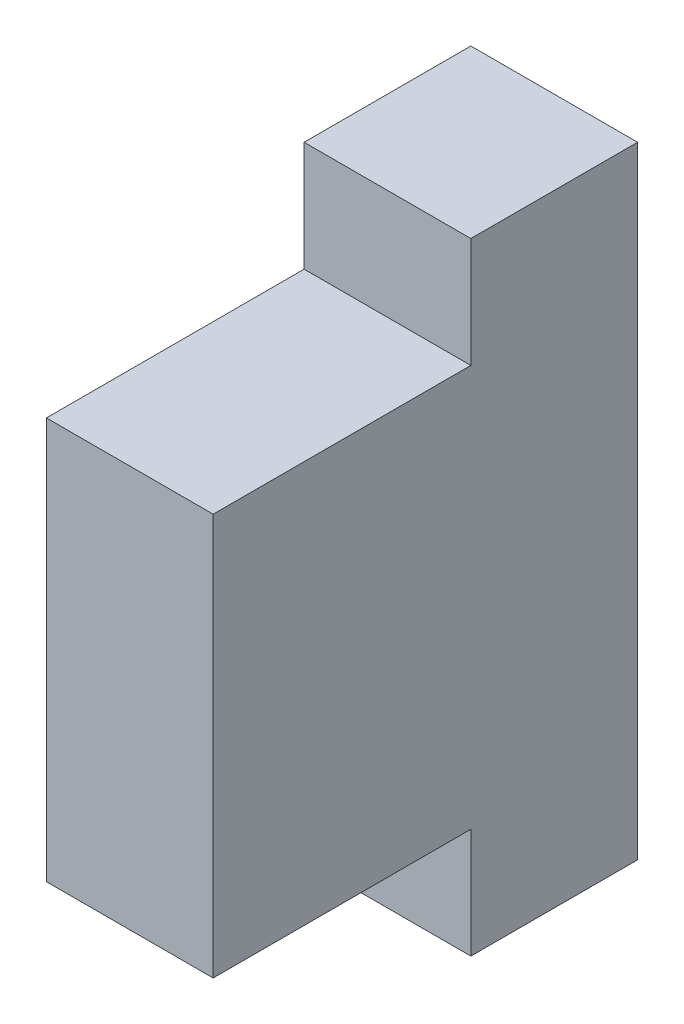
ISO-10303-21;
HEADER;
FILE_DESCRIPTION(('STEP AP214'),'2;1');
FILE_NAME('part.step','',(''),(''),'','','');
FILE_SCHEMA(('AUTOMOTIVE_DESIGN { 1 0 10303 214 1 1 1 1 }'));
ENDSEC;
DATA;
#1=APPLICATION_CONTEXT('core data for automotive mechanical design processes');
#2=APPLICATION_PROTOCOL_DEFINITION('international standard','automotive_design',2000,#1);
#3=PRODUCT_CONTEXT('',#1,'mechanical');
#4=PRODUCT('Part','Part','',(#3));
#5=PRODUCT_RELATED_PRODUCT_CATEGORY('part','',(#4));
#6=PRODUCT_DEFINITION_FORMATION('','',#4);
#7=PRODUCT_DEFINITION_CONTEXT('part definition',#1,'design');
#8=PRODUCT_DEFINITION('design','',#6,#7);
#9=PRODUCT_DEFINITION_SHAPE('','',#8);
#10=(LENGTH_UNIT() NAMED_UNIT(*) SI_UNIT(.MILLI.,.METRE.));
#11=(NAMED_UNIT(*) PLANE_ANGLE_UNIT() SI_UNIT($,.RADIAN.));
#12=(NAMED_UNIT(*) SI_UNIT($,.STERADIAN.) SOLID_ANGLE_UNIT());
#13=UNCERTAINTY_MEASURE_WITH_UNIT(LENGTH_MEASURE(1.E-05),#10,'distance_accuracy_value','');
#14=(GEOMETRIC_REPRESENTATION_CONTEXT(3) GLOBAL_UNCERTAINTY_ASSIGNED_CONTEXT((#13)) GLOBAL_UNIT_ASSIGNED_CONTEXT((#10,
#11,#12)) REPRESENTATION_CONTEXT('',''));
#15=CARTESIAN_POINT('',(0.,0.,0.));
#16=DIRECTION('',(0.,0.,1.));
#17=DIRECTION('',(1.,0.,0.));
#18=AXIS2_PLACEMENT_3D('',#15,#16,#17);
#19=CARTESIAN_POINT('',(-1.35,-1.6875,3.6));
#20=DIRECTION('',(0.,0.,-1.));
#21=DIRECTION('',(0.,-1.,0.));
#22=AXIS2_PLACEMENT_3D('',#19,#20,#21);
#23=PLANE('',#22);
#24=DIRECTION('',(0.,-1.,0.));
#25=VECTOR('',#24,1.);
#26=CARTESIAN_POINT('',(-0.8,-1.325,3.6));
#27=LINE('',#26,#25);
#28=CARTESIAN_POINT('',(-0.8,-1.325,3.6));
#29=VERTEX_POINT('',#28);
#30=CARTESIAN_POINT('',(-0.8,-2.05,3.6));
#31=VERTEX_POINT('',#30);
#32=EDGE_CURVE('E155',#29,#31,#27,.T.);
#33=ORIENTED_EDGE('',*,*,#32,.F.);
#34=DIRECTION('',(1.,0.,0.));
#35=VECTOR('',#34,1.);
#36=CARTESIAN_POINT('',(-1.9,-1.325,3.6));
#37=LINE('',#36,#35);
#38=CARTESIAN_POINT('',(-1.9,-1.325,3.6));
#39=VERTEX_POINT('',#38);
#40=EDGE_CURVE('E201',#39,#29,#37,.T.);
#41=ORIENTED_EDGE('',*,*,#40,.F.);
#42=DIRECTION('',(0.,1.,0.));
#43=VECTOR('',#42,1.);
#44=CARTESIAN_POINT('',(-1.9,-2.05,3.6));
#45=LINE('',#44,#43);
#46=CARTESIAN_POINT('',(-1.9,-2.05,3.6));
#47=VERTEX_POINT('',#46);
#48=EDGE_CURVE('E104',#47,#39,#45,.T.);
#49=ORIENTED_EDGE('',*,*,#48,.F.);
#50=DIRECTION('',(-1.,0.,0.));
#51=VECTOR('',#50,1.);
#52=CARTESIAN_POINT('',(-0.8,-2.05,3.6));
#53=LINE('',#52,#51);
#54=EDGE_CURVE('E11',#31,#47,#53,.T.);
#55=ORIENTED_EDGE('',*,*,#54,.F.);
#56=EDGE_LOOP('',(#33,#41,#49,#55));
#57=FACE_BOUND('',#56,.T.);
#58=ADVANCED_FACE('F16',(#57),#23,.F.);
#59=CARTESIAN_POINT('',(-1.35,-2.05,3.9));
#60=DIRECTION('',(0.,1.,0.));
#61=DIRECTION('',(0.,0.,-1.));
#62=AXIS2_PLACEMENT_3D('',#59,#60,#61);
#63=PLANE('',#62);
#64=DIRECTION('',(-1.,0.,0.));
#65=VECTOR('',#64,1.);
#66=CARTESIAN_POINT('',(-0.8,-2.05,2.5));
#67=LINE('',#66,#65);
#68=CARTESIAN_POINT('',(-0.8,-2.05,2.5));
#69=VERTEX_POINT('',#68);
#70=CARTESIAN_POINT('',(-1.9,-2.05,2.5));
#71=VERTEX_POINT('',#70);
#72=EDGE_CURVE('E27',#69,#71,#67,.T.);
#73=ORIENTED_EDGE('',*,*,#72,.F.);
#74=DIRECTION('',(0.,0.,-1.));
#75=VECTOR('',#74,1.);
#76=CARTESIAN_POINT('',(-0.8,-2.05,5.3));
#77=LINE('',#76,#75);
#78=EDGE_CURVE('E165',#31,#69,#77,.T.);
#79=ORIENTED_EDGE('',*,*,#78,.F.);
#80=ORIENTED_EDGE('',*,*,#54,.T.);
#81=DIRECTION('',(0.,0.,1.));
#82=VECTOR('',#81,1.);
#83=CARTESIAN_POINT('',(-1.9,-2.05,2.5));
#84=LINE('',#83,#82);
#85=EDGE_CURVE('E160',#71,#47,#84,.T.);
#86=ORIENTED_EDGE('',*,*,#85,.F.);
#87=EDGE_LOOP('',(#73,#79,#80,#86));
#88=FACE_BOUND('',#87,.T.);
#89=ADVANCED_FACE('F18',(#88),#63,.F.);
#90=CARTESIAN_POINT('',(-0.8,2.05,2.5));
#91=DIRECTION('',(0.,0.,-1.));
#92=DIRECTION('',(0.,-1.,0.));
#93=AXIS2_PLACEMENT_3D('',#90,#91,#92);
#94=PLANE('',#93);
#95=DIRECTION('',(0.,-1.,0.));
#96=VECTOR('',#95,1.);
#97=CARTESIAN_POINT('',(-0.8,2.05,2.5));
#98=LINE('',#97,#96);
#99=CARTESIAN_POINT('',(-0.8,2.05,2.5));
#100=VERTEX_POINT('',#99);
#101=EDGE_CURVE('E169',#100,#69,#98,.T.);
#102=ORIENTED_EDGE('',*,*,#101,.T.);
#103=ORIENTED_EDGE('',*,*,#72,.T.);
#104=DIRECTION('',(0.,-1.,0.));
#105=VECTOR('',#104,1.);
#106=CARTESIAN_POINT('',(-1.9,2.05,2.5));
#107=LINE('',#106,#105);
#108=CARTESIAN_POINT('',(-1.9,2.05,2.5));
#109=VERTEX_POINT('',#108);
#110=EDGE_CURVE('E156',#109,#71,#107,.T.);
#111=ORIENTED_EDGE('',*,*,#110,.F.);
#112=DIRECTION('',(-1.,0.,0.));
#113=VECTOR('',#112,1.);
#114=CARTESIAN_POINT('',(-0.8,2.05,2.5));
#115=LINE('',#114,#113);
#116=EDGE_CURVE('E90',#100,#109,#115,.T.);
#117=ORIENTED_EDGE('',*,*,#116,.F.);
#118=EDGE_LOOP('',(#102,#103,#111,#117));
#119=FACE_BOUND('',#118,.T.);
#120=ADVANCED_FACE('F257',(#119),#94,.T.);
#121=CARTESIAN_POINT('',(-1.35,2.05,3.9));
#122=DIRECTION('',(0.,1.,0.));
#123=DIRECTION('',(0.,0.,-1.));
#124=AXIS2_PLACEMENT_3D('',#121,#122,#123);
#125=PLANE('',#124);
#126=DIRECTION('',(0.,0.,1.));
#127=VECTOR('',#126,1.);
#128=CARTESIAN_POINT('',(-1.9,2.05,2.5));
#129=LINE('',#128,#127);
#130=CARTESIAN_POINT('',(-1.9,2.05,3.6));
#131=VERTEX_POINT('',#130);
#132=EDGE_CURVE('E161',#109,#131,#129,.T.);
#133=ORIENTED_EDGE('',*,*,#132,.T.);
#134=DIRECTION('',(1.,0.,0.));
#135=VECTOR('',#134,1.);
#136=CARTESIAN_POINT('',(-1.9,2.05,3.6));
#137=LINE('',#136,#135);
#138=CARTESIAN_POINT('',(-0.8,2.05,3.6));
#139=VERTEX_POINT('',#138);
#140=EDGE_CURVE('E97',#131,#139,#137,.T.);
#141=ORIENTED_EDGE('',*,*,#140,.T.);
#142=DIRECTION('',(0.,0.,-1.));
#143=VECTOR('',#142,1.);
#144=CARTESIAN_POINT('',(-0.8,2.05,5.3));
#145=LINE('',#144,#143);
#146=EDGE_CURVE('E172',#139,#100,#145,.T.);
#147=ORIENTED_EDGE('',*,*,#146,.T.);
#148=ORIENTED_EDGE('',*,*,#116,.T.);
#149=EDGE_LOOP('',(#133,#141,#147,#148));
#150=FACE_BOUND('',#149,.T.);
#151=ADVANCED_FACE('F262',(#150),#125,.T.);
#152=CARTESIAN_POINT('',(-1.35,1.6875,3.6));
#153=DIRECTION('',(0.,0.,-1.));
#154=DIRECTION('',(0.,-1.,0.));
#155=AXIS2_PLACEMENT_3D('',#152,#153,#154);
#156=PLANE('',#155);
#157=DIRECTION('',(0.,1.,0.));
#158=VECTOR('',#157,1.);
#159=CARTESIAN_POINT('',(-1.9,1.325,3.6));
#160=LINE('',#159,#158);
#161=CARTESIAN_POINT('',(-1.9,1.325,3.6));
#162=VERTEX_POINT('',#161);
#163=EDGE_CURVE('E164',#162,#131,#160,.T.);
#164=ORIENTED_EDGE('',*,*,#163,.F.);
#165=DIRECTION('',(-1.,0.,0.));
#166=VECTOR('',#165,1.);
#167=CARTESIAN_POINT('',(-0.8,1.325,3.6));
#168=LINE('',#167,#166);
#169=CARTESIAN_POINT('',(-0.8,1.325,3.6));
#170=VERTEX_POINT('',#169);
#171=EDGE_CURVE('E129',#170,#162,#168,.T.);
#172=ORIENTED_EDGE('',*,*,#171,.F.);
#173=DIRECTION('',(0.,-1.,0.));
#174=VECTOR('',#173,1.);
#175=CARTESIAN_POINT('',(-0.8,2.05,3.6));
#176=LINE('',#175,#174);
#177=EDGE_CURVE('E123',#139,#170,#176,.T.);
#178=ORIENTED_EDGE('',*,*,#177,.F.);
#179=ORIENTED_EDGE('',*,*,#140,.F.);
#180=EDGE_LOOP('',(#164,#172,#178,#179));
#181=FACE_BOUND('',#180,.T.);
#182=ADVANCED_FACE('F237',(#181),#156,.F.);
#183=CARTESIAN_POINT('',(-1.9,2.05,2.5));
#184=DIRECTION('',(-1.,0.,0.));
#185=DIRECTION('',(0.,0.,1.));
#186=AXIS2_PLACEMENT_3D('',#183,#184,#185);
#187=PLANE('',#186);
#188=ORIENTED_EDGE('',*,*,#132,.F.);
#189=ORIENTED_EDGE('',*,*,#110,.T.);
#190=ORIENTED_EDGE('',*,*,#85,.T.);
#191=ORIENTED_EDGE('',*,*,#48,.T.);
#192=DIRECTION('',(0.,0.,-1.));
#193=VECTOR('',#192,1.);
#194=CARTESIAN_POINT('',(-1.9,-1.325,5.3));
#195=LINE('',#194,#193);
#196=CARTESIAN_POINT('',(-1.9,-1.325,5.3));
#197=VERTEX_POINT('',#196);
#198=EDGE_CURVE('E175',#197,#39,#195,.T.);
#199=ORIENTED_EDGE('',*,*,#198,.F.);
#200=DIRECTION('',(0.,-1.,0.));
#201=VECTOR('',#200,1.);
#202=CARTESIAN_POINT('',(-1.9,2.05,5.3));
#203=LINE('',#202,#201);
#204=CARTESIAN_POINT('',(-1.9,1.325,5.3));
#205=VERTEX_POINT('',#204);
#206=EDGE_CURVE('E20',#205,#197,#203,.T.);
#207=ORIENTED_EDGE('',*,*,#206,.F.);
#208=DIRECTION('',(0.,0.,-1.));
#209=VECTOR('',#208,1.);
#210=CARTESIAN_POINT('',(-1.9,1.325,5.3));
#211=LINE('',#210,#209);
#212=EDGE_CURVE('E142',#205,#162,#211,.T.);
#213=ORIENTED_EDGE('',*,*,#212,.T.);
#214=ORIENTED_EDGE('',*,*,#163,.T.);
#215=EDGE_LOOP('',(#188,#189,#190,#191,#199,#207,#213,#214));
#216=FACE_BOUND('',#215,.T.);
#217=ADVANCED_FACE('F231',(#216),#187,.T.);
#218=CARTESIAN_POINT('',(-1.9,-1.325,5.3));
#219=DIRECTION('',(0.,-1.,0.));
#220=DIRECTION('',(-1.,0.,0.));
#221=AXIS2_PLACEMENT_3D('',#218,#219,#220);
#222=PLANE('',#221);
#223=ORIENTED_EDGE('',*,*,#198,.T.);
#224=ORIENTED_EDGE('',*,*,#40,.T.);
#225=DIRECTION('',(0.,0.,-1.));
#226=VECTOR('',#225,1.);
#227=CARTESIAN_POINT('',(-0.8,-1.325,5.3));
#228=LINE('',#227,#226);
#229=CARTESIAN_POINT('',(-0.8,-1.325,5.3));
#230=VERTEX_POINT('',#229);
#231=EDGE_CURVE('E152',#230,#29,#228,.T.);
#232=ORIENTED_EDGE('',*,*,#231,.F.);
#233=DIRECTION('',(1.,0.,0.));
#234=VECTOR('',#233,1.);
#235=CARTESIAN_POINT('',(-1.9,-1.325,5.3));
#236=LINE('',#235,#234);
#237=EDGE_CURVE('E137',#197,#230,#236,.T.);
#238=ORIENTED_EDGE('',*,*,#237,.F.);
#239=EDGE_LOOP('',(#223,#224,#232,#238));
#240=FACE_BOUND('',#239,.T.);
#241=ADVANCED_FACE('F236',(#240),#222,.T.);
#242=CARTESIAN_POINT('',(-0.8,2.05,5.3));
#243=DIRECTION('',(1.,0.,0.));
#244=DIRECTION('',(0.,1.,0.));
#245=AXIS2_PLACEMENT_3D('',#242,#243,#244);
#246=PLANE('',#245);
#247=DIRECTION('',(0.,0.,-1.));
#248=VECTOR('',#247,1.);
#249=CARTESIAN_POINT('',(-0.8,1.325,5.3));
#250=LINE('',#249,#248);
#251=CARTESIAN_POINT('',(-0.8,1.325,5.3));
#252=VERTEX_POINT('',#251);
#253=EDGE_CURVE('E116',#252,#170,#250,.T.);
#254=ORIENTED_EDGE('',*,*,#253,.F.);
#255=DIRECTION('',(0.,-1.,0.));
#256=VECTOR('',#255,1.);
#257=CARTESIAN_POINT('',(-0.8,2.05,5.3));
#258=LINE('',#257,#256);
#259=EDGE_CURVE('E120',#252,#230,#258,.T.);
#260=ORIENTED_EDGE('',*,*,#259,.T.);
#261=ORIENTED_EDGE('',*,*,#231,.T.);
#262=ORIENTED_EDGE('',*,*,#32,.T.);
#263=ORIENTED_EDGE('',*,*,#78,.T.);
#264=ORIENTED_EDGE('',*,*,#101,.F.);
#265=ORIENTED_EDGE('',*,*,#146,.F.);
#266=ORIENTED_EDGE('',*,*,#177,.T.);
#267=EDGE_LOOP('',(#254,#260,#261,#262,#263,#264,#265,#266));
#268=FACE_BOUND('',#267,.T.);
#269=ADVANCED_FACE('F118',(#268),#246,.T.);
#270=CARTESIAN_POINT('',(-0.8,1.325,5.3));
#271=DIRECTION('',(0.,1.,0.));
#272=DIRECTION('',(0.,0.,-1.));
#273=AXIS2_PLACEMENT_3D('',#270,#271,#272);
#274=PLANE('',#273);
#275=ORIENTED_EDGE('',*,*,#253,.T.);
#276=ORIENTED_EDGE('',*,*,#171,.T.);
#277=ORIENTED_EDGE('',*,*,#212,.F.);
#278=DIRECTION('',(-1.,0.,0.));
#279=VECTOR('',#278,1.);
#280=CARTESIAN_POINT('',(-0.8,1.325,5.3));
#281=LINE('',#280,#279);
#282=EDGE_CURVE('E135',#252,#205,#281,.T.);
#283=ORIENTED_EDGE('',*,*,#282,.F.);
#284=EDGE_LOOP('',(#275,#276,#277,#283));
#285=FACE_BOUND('',#284,.T.);
#286=ADVANCED_FACE('F140',(#285),#274,.T.);
#287=CARTESIAN_POINT('',(-1.9,2.05,5.3));
#288=DIRECTION('',(0.,0.,1.));
#289=DIRECTION('',(0.,-1.,0.));
#290=AXIS2_PLACEMENT_3D('',#287,#288,#289);
#291=PLANE('',#290);
#292=ORIENTED_EDGE('',*,*,#282,.T.);
#293=ORIENTED_EDGE('',*,*,#206,.T.);
#294=ORIENTED_EDGE('',*,*,#237,.T.);
#295=ORIENTED_EDGE('',*,*,#259,.F.);
#296=EDGE_LOOP('',(#292,#293,#294,#295));
#297=FACE_BOUND('',#296,.T.);
#298=ADVANCED_FACE('F133',(#297),#291,.T.);
#299=CLOSED_SHELL('',(#58,#89,#120,#151,#182,#217,#241,#269,#286,#298));
#300=MANIFOLD_SOLID_BREP('B1',#299);
#301=ADVANCED_BREP_SHAPE_REPRESENTATION('',(#18,#300),#14);
#302=SHAPE_DEFINITION_REPRESENTATION(#9,#301);
ENDSEC;
END-ISO-10303-21;
